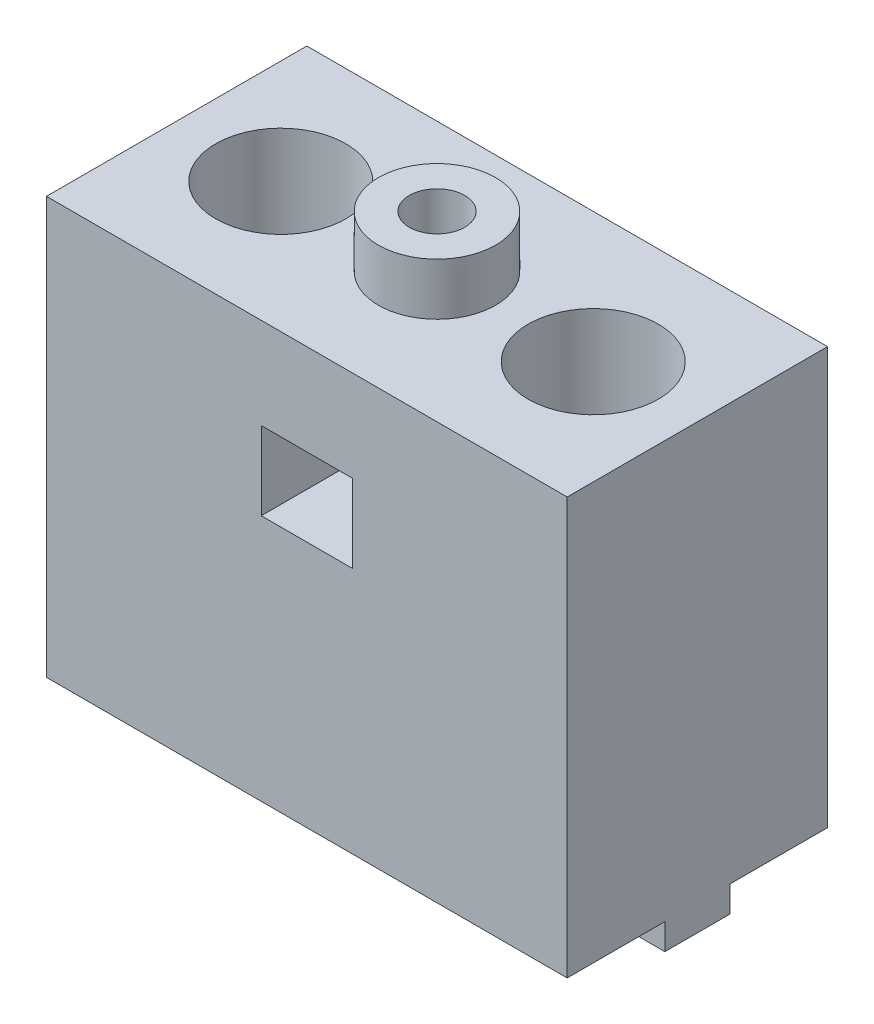
ISO-10303-21;
HEADER;
FILE_DESCRIPTION(('STEP AP214'),'2;1');
FILE_NAME('part.step','',(''),(''),'','','');
FILE_SCHEMA(('AUTOMOTIVE_DESIGN { 1 0 10303 214 1 1 1 1 }'));
ENDSEC;
DATA;
#1=APPLICATION_CONTEXT('core data for automotive mechanical design processes');
#2=APPLICATION_PROTOCOL_DEFINITION('international standard','automotive_design',2000,#1);
#3=PRODUCT_CONTEXT('',#1,'mechanical');
#4=PRODUCT('Part','Part','',(#3));
#5=PRODUCT_RELATED_PRODUCT_CATEGORY('part','',(#4));
#6=PRODUCT_DEFINITION_FORMATION('','',#4);
#7=PRODUCT_DEFINITION_CONTEXT('part definition',#1,'design');
#8=PRODUCT_DEFINITION('design','',#6,#7);
#9=PRODUCT_DEFINITION_SHAPE('','',#8);
#10=(LENGTH_UNIT() NAMED_UNIT(*) SI_UNIT(.MILLI.,.METRE.));
#11=(NAMED_UNIT(*) PLANE_ANGLE_UNIT() SI_UNIT($,.RADIAN.));
#12=(NAMED_UNIT(*) SI_UNIT($,.STERADIAN.) SOLID_ANGLE_UNIT());
#13=UNCERTAINTY_MEASURE_WITH_UNIT(LENGTH_MEASURE(1.E-05),#10,'distance_accuracy_value','');
#14=(GEOMETRIC_REPRESENTATION_CONTEXT(3) GLOBAL_UNCERTAINTY_ASSIGNED_CONTEXT((#13)) GLOBAL_UNIT_ASSIGNED_CONTEXT((#10,
#11,#12)) REPRESENTATION_CONTEXT('',''));
#15=CARTESIAN_POINT('',(0.,0.,0.));
#16=DIRECTION('',(0.,0.,1.));
#17=DIRECTION('',(1.,0.,0.));
#18=AXIS2_PLACEMENT_3D('',#15,#16,#17);
#19=CARTESIAN_POINT('',(40.,-2.,-7.5));
#20=DIRECTION('',(0.,0.,-1.));
#21=DIRECTION('',(-1.,0.,0.));
#22=AXIS2_PLACEMENT_3D('',#19,#20,#21);
#23=PLANE('',#22);
#24=DIRECTION('',(-1.,0.,0.));
#25=VECTOR('',#24,1.);
#26=CARTESIAN_POINT('',(40.,-2.,-7.5));
#27=LINE('',#26,#25);
#28=CARTESIAN_POINT('',(6.85435607626103,-2.,-7.5));
#29=VERTEX_POINT('',#28);
#30=CARTESIAN_POINT('',(0.,-2.,-7.50000000000001));
#31=VERTEX_POINT('',#30);
#32=EDGE_CURVE('E267',#29,#31,#27,.T.);
#33=ORIENTED_EDGE('',*,*,#32,.F.);
#34=DIRECTION('',(0.,1.,0.));
#35=VECTOR('',#34,1.);
#36=CARTESIAN_POINT('',(6.85435607626103,-2.,-7.5));
#37=LINE('',#36,#35);
#38=CARTESIAN_POINT('',(6.85435607626103,0.,-7.5));
#39=VERTEX_POINT('',#38);
#40=EDGE_CURVE('E241',#29,#39,#37,.T.);
#41=ORIENTED_EDGE('',*,*,#40,.T.);
#42=DIRECTION('',(-1.,0.,0.));
#43=VECTOR('',#42,1.);
#44=CARTESIAN_POINT('',(40.,0.,-7.5));
#45=LINE('',#44,#43);
#46=CARTESIAN_POINT('',(0.,0.,-7.50000000000001));
#47=VERTEX_POINT('',#46);
#48=EDGE_CURVE('E263',#39,#47,#45,.T.);
#49=ORIENTED_EDGE('',*,*,#48,.T.);
#50=DIRECTION('',(0.,1.,0.));
#51=VECTOR('',#50,1.);
#52=CARTESIAN_POINT('',(0.,-2.,-7.50000000000001));
#53=LINE('',#52,#51);
#54=EDGE_CURVE('E294',#31,#47,#53,.T.);
#55=ORIENTED_EDGE('',*,*,#54,.F.);
#56=EDGE_LOOP('',(#33,#41,#49,#55));
#57=FACE_BOUND('',#56,.T.);
#58=ADVANCED_FACE('F35',(#57),#23,.F.);
#59=CARTESIAN_POINT('',(40.,-2.,-12.5));
#60=DIRECTION('',(0.,0.,1.));
#61=DIRECTION('',(1.,0.,0.));
#62=AXIS2_PLACEMENT_3D('',#59,#60,#61);
#63=PLANE('',#62);
#64=DIRECTION('',(1.,0.,0.));
#65=VECTOR('',#64,1.);
#66=CARTESIAN_POINT('',(40.,-2.,-12.5));
#67=LINE('',#66,#65);
#68=CARTESIAN_POINT('',(9.14564392373894,-2.,-12.5));
#69=VERTEX_POINT('',#68);
#70=CARTESIAN_POINT('',(30.854356076261,-2.,-12.5));
#71=VERTEX_POINT('',#70);
#72=EDGE_CURVE('E280',#69,#71,#67,.T.);
#73=ORIENTED_EDGE('',*,*,#72,.F.);
#74=DIRECTION('',(0.,1.,0.));
#75=VECTOR('',#74,1.);
#76=CARTESIAN_POINT('',(9.14564392373895,-2.,-12.5));
#77=LINE('',#76,#75);
#78=CARTESIAN_POINT('',(9.14564392373894,0.,-12.5));
#79=VERTEX_POINT('',#78);
#80=EDGE_CURVE('E233',#69,#79,#77,.T.);
#81=ORIENTED_EDGE('',*,*,#80,.T.);
#82=DIRECTION('',(1.,0.,0.));
#83=VECTOR('',#82,1.);
#84=CARTESIAN_POINT('',(40.,0.,-12.5));
#85=LINE('',#84,#83);
#86=CARTESIAN_POINT('',(30.854356076261,0.,-12.5));
#87=VERTEX_POINT('',#86);
#88=EDGE_CURVE('E288',#79,#87,#85,.T.);
#89=ORIENTED_EDGE('',*,*,#88,.T.);
#90=DIRECTION('',(0.,1.,0.));
#91=VECTOR('',#90,1.);
#92=CARTESIAN_POINT('',(30.854356076261,-2.,-12.5));
#93=LINE('',#92,#91);
#94=EDGE_CURVE('E247',#87,#71,#93,.F.);
#95=ORIENTED_EDGE('',*,*,#94,.T.);
#96=EDGE_LOOP('',(#73,#81,#89,#95));
#97=FACE_BOUND('',#96,.T.);
#98=ADVANCED_FACE('F361',(#97),#63,.F.);
#99=CARTESIAN_POINT('',(0.,-2.,0.));
#100=DIRECTION('',(0.,1.,0.));
#101=DIRECTION('',(0.,0.,1.));
#102=AXIS2_PLACEMENT_3D('',#99,#100,#101);
#103=PLANE('',#102);
#104=CARTESIAN_POINT('',(30.854356076261,-2.,-7.5));
#105=VERTEX_POINT('',#104);
#106=CARTESIAN_POINT('',(9.14564392373897,-2.,-7.5));
#107=VERTEX_POINT('',#106);
#108=EDGE_CURVE('E273',#105,#107,#27,.T.);
#109=ORIENTED_EDGE('',*,*,#108,.T.);
#110=CARTESIAN_POINT('',(8.,-2.,-10.));
#111=DIRECTION('',(0.,1.,0.));
#112=DIRECTION('',(0.,0.,1.));
#113=AXIS2_PLACEMENT_3D('',#110,#111,#112);
#114=CIRCLE('',#113,2.75);
#115=EDGE_CURVE('E225',#107,#69,#114,.T.);
#116=ORIENTED_EDGE('',*,*,#115,.T.);
#117=ORIENTED_EDGE('',*,*,#72,.T.);
#118=CARTESIAN_POINT('',(32.,-2.,-10.));
#119=DIRECTION('',(0.,1.,0.));
#120=DIRECTION('',(0.,0.,1.));
#121=AXIS2_PLACEMENT_3D('',#118,#119,#120);
#122=CIRCLE('',#121,2.75);
#123=EDGE_CURVE('E333',#71,#105,#122,.T.);
#124=ORIENTED_EDGE('',*,*,#123,.T.);
#125=EDGE_LOOP('',(#109,#116,#117,#124));
#126=FACE_BOUND('',#125,.T.);
#127=ADVANCED_FACE('F369',(#126),#103,.F.);
#128=CARTESIAN_POINT('',(30.854356076261,0.,-7.5));
#129=VERTEX_POINT('',#128);
#130=CARTESIAN_POINT('',(9.14564392373897,0.,-7.5));
#131=VERTEX_POINT('',#130);
#132=EDGE_CURVE('E285',#129,#131,#45,.T.);
#133=ORIENTED_EDGE('',*,*,#132,.T.);
#134=DIRECTION('',(0.,1.,0.));
#135=VECTOR('',#134,1.);
#136=CARTESIAN_POINT('',(9.14564392373897,-2.,-7.5));
#137=LINE('',#136,#135);
#138=EDGE_CURVE('E238',#131,#107,#137,.F.);
#139=ORIENTED_EDGE('',*,*,#138,.T.);
#140=ORIENTED_EDGE('',*,*,#108,.F.);
#141=DIRECTION('',(0.,1.,0.));
#142=VECTOR('',#141,1.);
#143=CARTESIAN_POINT('',(30.854356076261,-2.,-7.5));
#144=LINE('',#143,#142);
#145=EDGE_CURVE('E260',#105,#129,#144,.T.);
#146=ORIENTED_EDGE('',*,*,#145,.T.);
#147=EDGE_LOOP('',(#133,#139,#140,#146));
#148=FACE_BOUND('',#147,.T.);
#149=ADVANCED_FACE('F364',(#148),#23,.F.);
#150=CARTESIAN_POINT('',(33.145643923739,-2.,-12.5));
#151=VERTEX_POINT('',#150);
#152=CARTESIAN_POINT('',(40.,-2.,-12.5));
#153=VERTEX_POINT('',#152);
#154=EDGE_CURVE('E275',#151,#153,#67,.T.);
#155=ORIENTED_EDGE('',*,*,#154,.F.);
#156=DIRECTION('',(0.,1.,0.));
#157=VECTOR('',#156,1.);
#158=CARTESIAN_POINT('',(33.145643923739,-2.,-12.5));
#159=LINE('',#158,#157);
#160=CARTESIAN_POINT('',(33.145643923739,0.,-12.5));
#161=VERTEX_POINT('',#160);
#162=EDGE_CURVE('E252',#151,#161,#159,.T.);
#163=ORIENTED_EDGE('',*,*,#162,.T.);
#164=CARTESIAN_POINT('',(40.,0.,-12.5));
#165=VERTEX_POINT('',#164);
#166=EDGE_CURVE('E284',#161,#165,#85,.T.);
#167=ORIENTED_EDGE('',*,*,#166,.T.);
#168=DIRECTION('',(0.,1.,0.));
#169=VECTOR('',#168,1.);
#170=CARTESIAN_POINT('',(40.,-2.,-12.5));
#171=LINE('',#170,#169);
#172=EDGE_CURVE('E279',#153,#165,#171,.T.);
#173=ORIENTED_EDGE('',*,*,#172,.F.);
#174=EDGE_LOOP('',(#155,#163,#167,#173));
#175=FACE_BOUND('',#174,.T.);
#176=ADVANCED_FACE('F372',(#175),#63,.F.);
#177=CARTESIAN_POINT('',(40.,-2.,-7.5));
#178=VERTEX_POINT('',#177);
#179=CARTESIAN_POINT('',(33.145643923739,-2.,-7.5));
#180=VERTEX_POINT('',#179);
#181=EDGE_CURVE('E269',#178,#180,#27,.T.);
#182=ORIENTED_EDGE('',*,*,#181,.T.);
#183=CARTESIAN_POINT('',(32.,-2.,-10.));
#184=DIRECTION('',(0.,1.,0.));
#185=DIRECTION('',(0.,0.,1.));
#186=AXIS2_PLACEMENT_3D('',#183,#184,#185);
#187=CIRCLE('',#186,2.75);
#188=EDGE_CURVE('E244',#180,#151,#187,.T.);
#189=ORIENTED_EDGE('',*,*,#188,.T.);
#190=ORIENTED_EDGE('',*,*,#154,.T.);
#191=DIRECTION('',(0.,0.,1.));
#192=VECTOR('',#191,1.);
#193=CARTESIAN_POINT('',(40.,-2.,-7.5));
#194=LINE('',#193,#192);
#195=EDGE_CURVE('E264',#153,#178,#194,.T.);
#196=ORIENTED_EDGE('',*,*,#195,.T.);
#197=EDGE_LOOP('',(#182,#189,#190,#196));
#198=FACE_BOUND('',#197,.T.);
#199=ADVANCED_FACE('F425',(#198),#103,.F.);
#200=CARTESIAN_POINT('',(0.,0.,0.));
#201=DIRECTION('',(0.,-1.,0.));
#202=DIRECTION('',(0.,0.,-1.));
#203=AXIS2_PLACEMENT_3D('',#200,#201,#202);
#204=PLANE('',#203);
#205=CARTESIAN_POINT('',(8.,0.,-10.));
#206=DIRECTION('',(0.,-1.,0.));
#207=DIRECTION('',(0.,0.,-1.));
#208=AXIS2_PLACEMENT_3D('',#205,#206,#207);
#209=CIRCLE('',#208,2.75);
#210=CARTESIAN_POINT('',(6.85435607626105,0.,-12.5));
#211=VERTEX_POINT('',#210);
#212=EDGE_CURVE('E231',#211,#79,#209,.T.);
#213=ORIENTED_EDGE('',*,*,#212,.F.);
#214=CARTESIAN_POINT('',(0.,0.,-12.5));
#215=VERTEX_POINT('',#214);
#216=EDGE_CURVE('E268',#215,#211,#85,.T.);
#217=ORIENTED_EDGE('',*,*,#216,.F.);
#218=DIRECTION('',(0.,0.,1.));
#219=VECTOR('',#218,1.);
#220=CARTESIAN_POINT('',(0.,0.,0.));
#221=LINE('',#220,#219);
#222=CARTESIAN_POINT('',(0.,0.,-20.));
#223=VERTEX_POINT('',#222);
#224=EDGE_CURVE('E312',#223,#215,#221,.T.);
#225=ORIENTED_EDGE('',*,*,#224,.F.);
#226=DIRECTION('',(-1.,0.,0.));
#227=VECTOR('',#226,1.);
#228=CARTESIAN_POINT('',(0.,0.,-20.));
#229=LINE('',#228,#227);
#230=CARTESIAN_POINT('',(40.,0.,-20.));
#231=VERTEX_POINT('',#230);
#232=EDGE_CURVE('E305',#231,#223,#229,.T.);
#233=ORIENTED_EDGE('',*,*,#232,.F.);
#234=DIRECTION('',(0.,0.,-1.));
#235=VECTOR('',#234,1.);
#236=CARTESIAN_POINT('',(40.,0.,0.));
#237=LINE('',#236,#235);
#238=EDGE_CURVE('E317',#165,#231,#237,.T.);
#239=ORIENTED_EDGE('',*,*,#238,.F.);
#240=ORIENTED_EDGE('',*,*,#166,.F.);
#241=CARTESIAN_POINT('',(32.,0.,-10.));
#242=DIRECTION('',(0.,-1.,0.));
#243=DIRECTION('',(0.,0.,-1.));
#244=AXIS2_PLACEMENT_3D('',#241,#242,#243);
#245=CIRCLE('',#244,2.75);
#246=EDGE_CURVE('E250',#87,#161,#245,.T.);
#247=ORIENTED_EDGE('',*,*,#246,.F.);
#248=ORIENTED_EDGE('',*,*,#88,.F.);
#249=EDGE_LOOP('',(#213,#217,#225,#233,#239,#240,#247,#248));
#250=FACE_BOUND('',#249,.T.);
#251=ADVANCED_FACE('F390',(#250),#204,.T.);
#252=CARTESIAN_POINT('',(0.,32.,0.));
#253=DIRECTION('',(1.,0.,0.));
#254=DIRECTION('',(0.,0.,-1.));
#255=AXIS2_PLACEMENT_3D('',#252,#253,#254);
#256=PLANE('',#255);
#257=ORIENTED_EDGE('',*,*,#224,.T.);
#258=DIRECTION('',(0.,1.,0.));
#259=VECTOR('',#258,1.);
#260=CARTESIAN_POINT('',(0.,-2.,-12.5));
#261=LINE('',#260,#259);
#262=CARTESIAN_POINT('',(0.,-2.,-12.5));
#263=VERTEX_POINT('',#262);
#264=EDGE_CURVE('E291',#263,#215,#261,.T.);
#265=ORIENTED_EDGE('',*,*,#264,.F.);
#266=DIRECTION('',(0.,0.,-1.));
#267=VECTOR('',#266,1.);
#268=CARTESIAN_POINT('',(0.,-2.,-7.50000000000001));
#269=LINE('',#268,#267);
#270=EDGE_CURVE('E272',#31,#263,#269,.T.);
#271=ORIENTED_EDGE('',*,*,#270,.F.);
#272=ORIENTED_EDGE('',*,*,#54,.T.);
#273=CARTESIAN_POINT('',(0.,0.,0.));
#274=VERTEX_POINT('',#273);
#275=EDGE_CURVE('E300',#47,#274,#221,.T.);
#276=ORIENTED_EDGE('',*,*,#275,.T.);
#277=DIRECTION('',(0.,-1.,0.));
#278=VECTOR('',#277,1.);
#279=CARTESIAN_POINT('',(0.,32.,0.));
#280=LINE('',#279,#278);
#281=CARTESIAN_POINT('',(0.,32.,0.));
#282=VERTEX_POINT('',#281);
#283=EDGE_CURVE('E330',#282,#274,#280,.T.);
#284=ORIENTED_EDGE('',*,*,#283,.F.);
#285=DIRECTION('',(0.,0.,1.));
#286=VECTOR('',#285,1.);
#287=CARTESIAN_POINT('',(0.,32.,0.));
#288=LINE('',#287,#286);
#289=CARTESIAN_POINT('',(0.,32.,-20.));
#290=VERTEX_POINT('',#289);
#291=EDGE_CURVE('E301',#290,#282,#288,.T.);
#292=ORIENTED_EDGE('',*,*,#291,.F.);
#293=DIRECTION('',(0.,-1.,0.));
#294=VECTOR('',#293,1.);
#295=CARTESIAN_POINT('',(0.,32.,-20.));
#296=LINE('',#295,#294);
#297=EDGE_CURVE('E311',#290,#223,#296,.T.);
#298=ORIENTED_EDGE('',*,*,#297,.T.);
#299=EDGE_LOOP('',(#257,#265,#271,#272,#276,#284,#292,#298));
#300=FACE_BOUND('',#299,.T.);
#301=ADVANCED_FACE('F37',(#300),#256,.F.);
#302=CARTESIAN_POINT('',(0.,32.,0.));
#303=DIRECTION('',(0.,0.,-1.));
#304=DIRECTION('',(-1.,0.,0.));
#305=AXIS2_PLACEMENT_3D('',#302,#303,#304);
#306=PLANE('',#305);
#307=DIRECTION('',(1.,0.,0.));
#308=VECTOR('',#307,1.);
#309=CARTESIAN_POINT('',(16.5,19.,0.));
#310=LINE('',#309,#308);
#311=CARTESIAN_POINT('',(16.5,19.,0.));
#312=VERTEX_POINT('',#311);
#313=CARTESIAN_POINT('',(23.5,19.,0.));
#314=VERTEX_POINT('',#313);
#315=EDGE_CURVE('E202',#312,#314,#310,.T.);
#316=ORIENTED_EDGE('',*,*,#315,.F.);
#317=DIRECTION('',(0.,-1.,0.));
#318=VECTOR('',#317,1.);
#319=CARTESIAN_POINT('',(16.5,19.,0.));
#320=LINE('',#319,#318);
#321=CARTESIAN_POINT('',(16.5,25.,0.));
#322=VERTEX_POINT('',#321);
#323=EDGE_CURVE('E50',#322,#312,#320,.T.);
#324=ORIENTED_EDGE('',*,*,#323,.F.);
#325=DIRECTION('',(-1.,0.,0.));
#326=VECTOR('',#325,1.);
#327=CARTESIAN_POINT('',(16.5,25.,0.));
#328=LINE('',#327,#326);
#329=CARTESIAN_POINT('',(23.5,25.,0.));
#330=VERTEX_POINT('',#329);
#331=EDGE_CURVE('E190',#330,#322,#328,.T.);
#332=ORIENTED_EDGE('',*,*,#331,.F.);
#333=DIRECTION('',(0.,1.,0.));
#334=VECTOR('',#333,1.);
#335=CARTESIAN_POINT('',(23.5,19.,0.));
#336=LINE('',#335,#334);
#337=EDGE_CURVE('E193',#314,#330,#336,.T.);
#338=ORIENTED_EDGE('',*,*,#337,.F.);
#339=EDGE_LOOP('',(#316,#324,#332,#338));
#340=FACE_BOUND('',#339,.T.);
#341=DIRECTION('',(1.,0.,0.));
#342=VECTOR('',#341,1.);
#343=CARTESIAN_POINT('',(0.,0.,0.));
#344=LINE('',#343,#342);
#345=CARTESIAN_POINT('',(40.,0.,0.));
#346=VERTEX_POINT('',#345);
#347=EDGE_CURVE('E315',#274,#346,#344,.T.);
#348=ORIENTED_EDGE('',*,*,#347,.T.);
#349=DIRECTION('',(0.,-1.,0.));
#350=VECTOR('',#349,1.);
#351=CARTESIAN_POINT('',(40.,32.,0.));
#352=LINE('',#351,#350);
#353=CARTESIAN_POINT('',(40.,32.,0.));
#354=VERTEX_POINT('',#353);
#355=EDGE_CURVE('E327',#354,#346,#352,.T.);
#356=ORIENTED_EDGE('',*,*,#355,.F.);
#357=DIRECTION('',(1.,0.,0.));
#358=VECTOR('',#357,1.);
#359=CARTESIAN_POINT('',(0.,32.,0.));
#360=LINE('',#359,#358);
#361=EDGE_CURVE('E304',#282,#354,#360,.T.);
#362=ORIENTED_EDGE('',*,*,#361,.F.);
#363=ORIENTED_EDGE('',*,*,#283,.T.);
#364=EDGE_LOOP('',(#348,#356,#362,#363));
#365=FACE_BOUND('',#364,.T.);
#366=ADVANCED_FACE('F404',(#340,#365),#306,.F.);
#367=CARTESIAN_POINT('',(40.,32.,0.));
#368=DIRECTION('',(-1.,0.,0.));
#369=DIRECTION('',(0.,0.,1.));
#370=AXIS2_PLACEMENT_3D('',#367,#368,#369);
#371=PLANE('',#370);
#372=CARTESIAN_POINT('',(40.,0.,-7.5));
#373=VERTEX_POINT('',#372);
#374=EDGE_CURVE('E318',#346,#373,#237,.T.);
#375=ORIENTED_EDGE('',*,*,#374,.T.);
#376=DIRECTION('',(0.,1.,0.));
#377=VECTOR('',#376,1.);
#378=CARTESIAN_POINT('',(40.,-2.,-7.5));
#379=LINE('',#378,#377);
#380=EDGE_CURVE('E297',#178,#373,#379,.T.);
#381=ORIENTED_EDGE('',*,*,#380,.F.);
#382=ORIENTED_EDGE('',*,*,#195,.F.);
#383=ORIENTED_EDGE('',*,*,#172,.T.);
#384=ORIENTED_EDGE('',*,*,#238,.T.);
#385=DIRECTION('',(0.,-1.,0.));
#386=VECTOR('',#385,1.);
#387=CARTESIAN_POINT('',(40.,32.,-20.));
#388=LINE('',#387,#386);
#389=CARTESIAN_POINT('',(40.,32.,-20.));
#390=VERTEX_POINT('',#389);
#391=EDGE_CURVE('E324',#390,#231,#388,.T.);
#392=ORIENTED_EDGE('',*,*,#391,.F.);
#393=DIRECTION('',(0.,0.,-1.));
#394=VECTOR('',#393,1.);
#395=CARTESIAN_POINT('',(40.,32.,0.));
#396=LINE('',#395,#394);
#397=EDGE_CURVE('E307',#354,#390,#396,.T.);
#398=ORIENTED_EDGE('',*,*,#397,.F.);
#399=ORIENTED_EDGE('',*,*,#355,.T.);
#400=EDGE_LOOP('',(#375,#381,#382,#383,#384,#392,#398,#399));
#401=FACE_BOUND('',#400,.T.);
#402=ADVANCED_FACE('F398',(#401),#371,.F.);
#403=CARTESIAN_POINT('',(0.,32.,-20.));
#404=DIRECTION('',(0.,0.,1.));
#405=DIRECTION('',(1.,0.,0.));
#406=AXIS2_PLACEMENT_3D('',#403,#404,#405);
#407=PLANE('',#406);
#408=DIRECTION('',(-1.,0.,0.));
#409=VECTOR('',#408,1.);
#410=CARTESIAN_POINT('',(16.5,25.,-20.));
#411=LINE('',#410,#409);
#412=CARTESIAN_POINT('',(23.5,25.,-20.));
#413=VERTEX_POINT('',#412);
#414=CARTESIAN_POINT('',(16.5,25.,-20.));
#415=VERTEX_POINT('',#414);
#416=EDGE_CURVE('E180',#413,#415,#411,.T.);
#417=ORIENTED_EDGE('',*,*,#416,.T.);
#418=DIRECTION('',(0.,-1.,0.));
#419=VECTOR('',#418,1.);
#420=CARTESIAN_POINT('',(16.5,19.,-20.));
#421=LINE('',#420,#419);
#422=CARTESIAN_POINT('',(16.5,19.,-20.));
#423=VERTEX_POINT('',#422);
#424=EDGE_CURVE('E174',#415,#423,#421,.T.);
#425=ORIENTED_EDGE('',*,*,#424,.T.);
#426=DIRECTION('',(1.,0.,0.));
#427=VECTOR('',#426,1.);
#428=CARTESIAN_POINT('',(16.5,19.,-20.));
#429=LINE('',#428,#427);
#430=CARTESIAN_POINT('',(23.5,19.,-20.));
#431=VERTEX_POINT('',#430);
#432=EDGE_CURVE('E183',#423,#431,#429,.T.);
#433=ORIENTED_EDGE('',*,*,#432,.T.);
#434=DIRECTION('',(0.,1.,0.));
#435=VECTOR('',#434,1.);
#436=CARTESIAN_POINT('',(23.5,19.,-20.));
#437=LINE('',#436,#435);
#438=EDGE_CURVE('E58',#431,#413,#437,.T.);
#439=ORIENTED_EDGE('',*,*,#438,.T.);
#440=EDGE_LOOP('',(#417,#425,#433,#439));
#441=FACE_BOUND('',#440,.T.);
#442=ORIENTED_EDGE('',*,*,#232,.T.);
#443=ORIENTED_EDGE('',*,*,#297,.F.);
#444=DIRECTION('',(-1.,0.,0.));
#445=VECTOR('',#444,1.);
#446=CARTESIAN_POINT('',(0.,32.,-20.));
#447=LINE('',#446,#445);
#448=EDGE_CURVE('E309',#390,#290,#447,.T.);
#449=ORIENTED_EDGE('',*,*,#448,.F.);
#450=ORIENTED_EDGE('',*,*,#391,.T.);
#451=EDGE_LOOP('',(#442,#443,#449,#450));
#452=FACE_BOUND('',#451,.T.);
#453=ADVANCED_FACE('F187',(#441,#452),#407,.F.);
#454=CARTESIAN_POINT('',(0.,32.,0.));
#455=DIRECTION('',(0.,-1.,0.));
#456=DIRECTION('',(0.,0.,-1.));
#457=AXIS2_PLACEMENT_3D('',#454,#455,#456);
#458=PLANE('',#457);
#459=CARTESIAN_POINT('',(20.,32.,-10.));
#460=DIRECTION('',(0.,-1.,0.));
#461=DIRECTION('',(0.,0.,-1.));
#462=AXIS2_PLACEMENT_3D('',#459,#460,#461);
#463=CIRCLE('',#462,4.5);
#464=CARTESIAN_POINT('',(20.,32.,-14.5));
#465=VERTEX_POINT('',#464);
#466=EDGE_CURVE('E12',#465,#465,#463,.F.);
#467=ORIENTED_EDGE('',*,*,#466,.F.);
#468=EDGE_LOOP('',(#467));
#469=FACE_BOUND('',#468,.T.);
#470=CARTESIAN_POINT('',(32.,32.,-10.));
#471=DIRECTION('',(0.,1.,0.));
#472=DIRECTION('',(0.,0.,1.));
#473=AXIS2_PLACEMENT_3D('',#470,#471,#472);
#474=CIRCLE('',#473,5.);
#475=CARTESIAN_POINT('',(32.,32.,-5.));
#476=VERTEX_POINT('',#475);
#477=EDGE_CURVE('E208',#476,#476,#474,.T.);
#478=ORIENTED_EDGE('',*,*,#477,.F.);
#479=EDGE_LOOP('',(#478));
#480=FACE_BOUND('',#479,.T.);
#481=CARTESIAN_POINT('',(8.,32.,-10.));
#482=DIRECTION('',(0.,1.,0.));
#483=DIRECTION('',(0.,0.,1.));
#484=AXIS2_PLACEMENT_3D('',#481,#482,#483);
#485=CIRCLE('',#484,5.);
#486=CARTESIAN_POINT('',(8.,32.,-5.));
#487=VERTEX_POINT('',#486);
#488=EDGE_CURVE('E218',#487,#487,#485,.T.);
#489=ORIENTED_EDGE('',*,*,#488,.F.);
#490=EDGE_LOOP('',(#489));
#491=FACE_BOUND('',#490,.T.);
#492=ORIENTED_EDGE('',*,*,#291,.T.);
#493=ORIENTED_EDGE('',*,*,#361,.T.);
#494=ORIENTED_EDGE('',*,*,#397,.T.);
#495=ORIENTED_EDGE('',*,*,#448,.T.);
#496=EDGE_LOOP('',(#492,#493,#494,#495));
#497=FACE_BOUND('',#496,.T.);
#498=ADVANCED_FACE('F387',(#469,#480,#491,#497),#458,.F.);
#499=CARTESIAN_POINT('',(8.,0.,-10.));
#500=DIRECTION('',(0.,-1.,0.));
#501=DIRECTION('',(0.,0.,-1.));
#502=AXIS2_PLACEMENT_3D('',#499,#500,#501);
#503=CIRCLE('',#502,2.75);
#504=EDGE_CURVE('E236',#131,#39,#503,.T.);
#505=ORIENTED_EDGE('',*,*,#504,.F.);
#506=ORIENTED_EDGE('',*,*,#132,.F.);
#507=CARTESIAN_POINT('',(32.,0.,-10.));
#508=DIRECTION('',(0.,-1.,0.));
#509=DIRECTION('',(0.,0.,-1.));
#510=AXIS2_PLACEMENT_3D('',#507,#508,#509);
#511=CIRCLE('',#510,2.75);
#512=CARTESIAN_POINT('',(33.145643923739,0.,-7.5));
#513=VERTEX_POINT('',#512);
#514=EDGE_CURVE('E258',#513,#129,#511,.T.);
#515=ORIENTED_EDGE('',*,*,#514,.F.);
#516=EDGE_CURVE('E281',#373,#513,#45,.T.);
#517=ORIENTED_EDGE('',*,*,#516,.F.);
#518=ORIENTED_EDGE('',*,*,#374,.F.);
#519=ORIENTED_EDGE('',*,*,#347,.F.);
#520=ORIENTED_EDGE('',*,*,#275,.F.);
#521=ORIENTED_EDGE('',*,*,#48,.F.);
#522=EDGE_LOOP('',(#505,#506,#515,#517,#518,#519,#520,#521));
#523=FACE_BOUND('',#522,.T.);
#524=ADVANCED_FACE('F379',(#523),#204,.T.);
#525=ORIENTED_EDGE('',*,*,#516,.T.);
#526=DIRECTION('',(0.,1.,0.));
#527=VECTOR('',#526,1.);
#528=CARTESIAN_POINT('',(33.145643923739,-2.,-7.5));
#529=LINE('',#528,#527);
#530=EDGE_CURVE('E255',#513,#180,#529,.F.);
#531=ORIENTED_EDGE('',*,*,#530,.T.);
#532=ORIENTED_EDGE('',*,*,#181,.F.);
#533=ORIENTED_EDGE('',*,*,#380,.T.);
#534=EDGE_LOOP('',(#525,#531,#532,#533));
#535=FACE_BOUND('',#534,.T.);
#536=ADVANCED_FACE('F365',(#535),#23,.F.);
#537=ORIENTED_EDGE('',*,*,#216,.T.);
#538=DIRECTION('',(0.,1.,0.));
#539=VECTOR('',#538,1.);
#540=CARTESIAN_POINT('',(6.85435607626105,-2.,-12.5));
#541=LINE('',#540,#539);
#542=CARTESIAN_POINT('',(6.85435607626106,-2.,-12.5));
#543=VERTEX_POINT('',#542);
#544=EDGE_CURVE('E228',#211,#543,#541,.F.);
#545=ORIENTED_EDGE('',*,*,#544,.T.);
#546=EDGE_CURVE('E276',#263,#543,#67,.T.);
#547=ORIENTED_EDGE('',*,*,#546,.F.);
#548=ORIENTED_EDGE('',*,*,#264,.T.);
#549=EDGE_LOOP('',(#537,#545,#547,#548));
#550=FACE_BOUND('',#549,.T.);
#551=ADVANCED_FACE('F373',(#550),#63,.F.);
#552=ORIENTED_EDGE('',*,*,#546,.T.);
#553=CARTESIAN_POINT('',(8.,-2.,-10.));
#554=DIRECTION('',(0.,1.,0.));
#555=DIRECTION('',(0.,0.,1.));
#556=AXIS2_PLACEMENT_3D('',#553,#554,#555);
#557=CIRCLE('',#556,2.75);
#558=EDGE_CURVE('E43',#543,#29,#557,.T.);
#559=ORIENTED_EDGE('',*,*,#558,.T.);
#560=ORIENTED_EDGE('',*,*,#32,.T.);
#561=ORIENTED_EDGE('',*,*,#270,.T.);
#562=EDGE_LOOP('',(#552,#559,#560,#561));
#563=FACE_BOUND('',#562,.T.);
#564=ADVANCED_FACE('F385',(#563),#103,.F.);
#565=CARTESIAN_POINT('',(32.,-2.,-10.));
#566=DIRECTION('',(0.,1.,0.));
#567=DIRECTION('',(0.,0.,1.));
#568=AXIS2_PLACEMENT_3D('',#565,#566,#567);
#569=CYLINDRICAL_SURFACE('',#568,2.75);
#570=CARTESIAN_POINT('',(32.,5.,-10.));
#571=DIRECTION('',(0.,-1.,0.));
#572=DIRECTION('',(0.,0.,-1.));
#573=AXIS2_PLACEMENT_3D('',#570,#571,#572);
#574=CIRCLE('',#573,2.75);
#575=CARTESIAN_POINT('',(32.,5.,-12.75));
#576=VERTEX_POINT('',#575);
#577=EDGE_CURVE('E217',#576,#576,#574,.F.);
#578=ORIENTED_EDGE('',*,*,#577,.T.);
#579=EDGE_LOOP('',(#578));
#580=FACE_BOUND('',#579,.T.);
#581=ORIENTED_EDGE('',*,*,#123,.F.);
#582=ORIENTED_EDGE('',*,*,#94,.F.);
#583=ORIENTED_EDGE('',*,*,#246,.T.);
#584=ORIENTED_EDGE('',*,*,#162,.F.);
#585=ORIENTED_EDGE('',*,*,#188,.F.);
#586=ORIENTED_EDGE('',*,*,#530,.F.);
#587=ORIENTED_EDGE('',*,*,#514,.T.);
#588=ORIENTED_EDGE('',*,*,#145,.F.);
#589=EDGE_LOOP('',(#581,#582,#583,#584,#585,#586,#587,#588));
#590=FACE_BOUND('',#589,.T.);
#591=ADVANCED_FACE('F342',(#580,#590),#569,.F.);
#592=CARTESIAN_POINT('',(8.,-2.,-10.));
#593=DIRECTION('',(0.,1.,0.));
#594=DIRECTION('',(0.,0.,1.));
#595=AXIS2_PLACEMENT_3D('',#592,#593,#594);
#596=CYLINDRICAL_SURFACE('',#595,2.75);
#597=CARTESIAN_POINT('',(8.,5.,-10.));
#598=DIRECTION('',(0.,-1.,0.));
#599=DIRECTION('',(0.,0.,-1.));
#600=AXIS2_PLACEMENT_3D('',#597,#598,#599);
#601=CIRCLE('',#600,2.75);
#602=CARTESIAN_POINT('',(8.,5.,-12.75));
#603=VERTEX_POINT('',#602);
#604=EDGE_CURVE('E224',#603,#603,#601,.F.);
#605=ORIENTED_EDGE('',*,*,#604,.T.);
#606=EDGE_LOOP('',(#605));
#607=FACE_BOUND('',#606,.T.);
#608=ORIENTED_EDGE('',*,*,#558,.F.);
#609=ORIENTED_EDGE('',*,*,#544,.F.);
#610=ORIENTED_EDGE('',*,*,#212,.T.);
#611=ORIENTED_EDGE('',*,*,#80,.F.);
#612=ORIENTED_EDGE('',*,*,#115,.F.);
#613=ORIENTED_EDGE('',*,*,#138,.F.);
#614=ORIENTED_EDGE('',*,*,#504,.T.);
#615=ORIENTED_EDGE('',*,*,#40,.F.);
#616=EDGE_LOOP('',(#608,#609,#610,#611,#612,#613,#614,#615));
#617=FACE_BOUND('',#616,.T.);
#618=ADVANCED_FACE('F416',(#607,#617),#596,.F.);
#619=CARTESIAN_POINT('',(0.,5.,0.));
#620=DIRECTION('',(0.,-1.,0.));
#621=DIRECTION('',(0.,0.,-1.));
#622=AXIS2_PLACEMENT_3D('',#619,#620,#621);
#623=PLANE('',#622);
#624=CARTESIAN_POINT('',(8.,5.,-10.));
#625=DIRECTION('',(0.,-1.,0.));
#626=DIRECTION('',(0.,0.,-1.));
#627=AXIS2_PLACEMENT_3D('',#624,#625,#626);
#628=CIRCLE('',#627,5.);
#629=CARTESIAN_POINT('',(8.,5.,-15.));
#630=VERTEX_POINT('',#629);
#631=EDGE_CURVE('E221',#630,#630,#628,.F.);
#632=ORIENTED_EDGE('',*,*,#631,.T.);
#633=EDGE_LOOP('',(#632));
#634=FACE_BOUND('',#633,.T.);
#635=ORIENTED_EDGE('',*,*,#604,.F.);
#636=EDGE_LOOP('',(#635));
#637=FACE_BOUND('',#636,.T.);
#638=ADVANCED_FACE('F357',(#634,#637),#623,.F.);
#639=CARTESIAN_POINT('',(8.,-14.1421356237309,-10.));
#640=DIRECTION('',(0.,1.,0.));
#641=DIRECTION('',(0.,0.,1.));
#642=AXIS2_PLACEMENT_3D('',#639,#640,#641);
#643=CYLINDRICAL_SURFACE('',#642,5.);
#644=ORIENTED_EDGE('',*,*,#488,.T.);
#645=EDGE_LOOP('',(#644));
#646=FACE_BOUND('',#645,.T.);
#647=ORIENTED_EDGE('',*,*,#631,.F.);
#648=EDGE_LOOP('',(#647));
#649=FACE_BOUND('',#648,.T.);
#650=ADVANCED_FACE('F348',(#646,#649),#643,.F.);
#651=CARTESIAN_POINT('',(0.,5.,0.));
#652=DIRECTION('',(0.,-1.,0.));
#653=DIRECTION('',(0.,0.,-1.));
#654=AXIS2_PLACEMENT_3D('',#651,#652,#653);
#655=PLANE('',#654);
#656=CARTESIAN_POINT('',(32.,5.,-10.));
#657=DIRECTION('',(0.,-1.,0.));
#658=DIRECTION('',(0.,0.,-1.));
#659=AXIS2_PLACEMENT_3D('',#656,#657,#658);
#660=CIRCLE('',#659,5.);
#661=CARTESIAN_POINT('',(32.,5.,-15.));
#662=VERTEX_POINT('',#661);
#663=EDGE_CURVE('E214',#662,#662,#660,.F.);
#664=ORIENTED_EDGE('',*,*,#663,.T.);
#665=EDGE_LOOP('',(#664));
#666=FACE_BOUND('',#665,.T.);
#667=ORIENTED_EDGE('',*,*,#577,.F.);
#668=EDGE_LOOP('',(#667));
#669=FACE_BOUND('',#668,.T.);
#670=ADVANCED_FACE('F345',(#666,#669),#655,.F.);
#671=CARTESIAN_POINT('',(32.,-14.1421356237309,-10.));
#672=DIRECTION('',(0.,1.,0.));
#673=DIRECTION('',(0.,0.,1.));
#674=AXIS2_PLACEMENT_3D('',#671,#672,#673);
#675=CYLINDRICAL_SURFACE('',#674,5.);
#676=ORIENTED_EDGE('',*,*,#477,.T.);
#677=EDGE_LOOP('',(#676));
#678=FACE_BOUND('',#677,.T.);
#679=ORIENTED_EDGE('',*,*,#663,.F.);
#680=EDGE_LOOP('',(#679));
#681=FACE_BOUND('',#680,.T.);
#682=ADVANCED_FACE('F347',(#678,#681),#675,.F.);
#683=CARTESIAN_POINT('',(16.5,19.,-20.));
#684=DIRECTION('',(-1.,0.,0.));
#685=DIRECTION('',(0.,0.,1.));
#686=AXIS2_PLACEMENT_3D('',#683,#684,#685);
#687=PLANE('',#686);
#688=ORIENTED_EDGE('',*,*,#323,.T.);
#689=DIRECTION('',(0.,0.,1.));
#690=VECTOR('',#689,1.);
#691=CARTESIAN_POINT('',(16.5,19.,-20.));
#692=LINE('',#691,#690);
#693=EDGE_CURVE('E170',#423,#312,#692,.T.);
#694=ORIENTED_EDGE('',*,*,#693,.F.);
#695=ORIENTED_EDGE('',*,*,#424,.F.);
#696=DIRECTION('',(0.,0.,1.));
#697=VECTOR('',#696,1.);
#698=CARTESIAN_POINT('',(16.5,25.,-20.));
#699=LINE('',#698,#697);
#700=EDGE_CURVE('E206',#415,#322,#699,.T.);
#701=ORIENTED_EDGE('',*,*,#700,.T.);
#702=EDGE_LOOP('',(#688,#694,#695,#701));
#703=FACE_BOUND('',#702,.T.);
#704=ADVANCED_FACE('F172',(#703),#687,.F.);
#705=CARTESIAN_POINT('',(16.5,25.,-20.));
#706=DIRECTION('',(0.,1.,0.));
#707=DIRECTION('',(0.,0.,1.));
#708=AXIS2_PLACEMENT_3D('',#705,#706,#707);
#709=PLANE('',#708);
#710=CARTESIAN_POINT('',(20.,25.,-10.));
#711=DIRECTION('',(0.,1.,0.));
#712=DIRECTION('',(0.,0.,1.));
#713=AXIS2_PLACEMENT_3D('',#710,#711,#712);
#714=CIRCLE('',#713,2.125);
#715=CARTESIAN_POINT('',(20.,25.,-7.875));
#716=VERTEX_POINT('',#715);
#717=EDGE_CURVE('E598',#716,#716,#714,.T.);
#718=ORIENTED_EDGE('',*,*,#717,.T.);
#719=EDGE_LOOP('',(#718));
#720=FACE_BOUND('',#719,.T.);
#721=ORIENTED_EDGE('',*,*,#331,.T.);
#722=ORIENTED_EDGE('',*,*,#700,.F.);
#723=ORIENTED_EDGE('',*,*,#416,.F.);
#724=DIRECTION('',(0.,0.,1.));
#725=VECTOR('',#724,1.);
#726=CARTESIAN_POINT('',(23.5,25.,-20.));
#727=LINE('',#726,#725);
#728=EDGE_CURVE('E209',#413,#330,#727,.T.);
#729=ORIENTED_EDGE('',*,*,#728,.T.);
#730=EDGE_LOOP('',(#721,#722,#723,#729));
#731=FACE_BOUND('',#730,.T.);
#732=ADVANCED_FACE('F504',(#720,#731),#709,.F.);
#733=CARTESIAN_POINT('',(23.5,19.,-20.));
#734=DIRECTION('',(1.,0.,0.));
#735=DIRECTION('',(0.,0.,-1.));
#736=AXIS2_PLACEMENT_3D('',#733,#734,#735);
#737=PLANE('',#736);
#738=ORIENTED_EDGE('',*,*,#337,.T.);
#739=ORIENTED_EDGE('',*,*,#728,.F.);
#740=ORIENTED_EDGE('',*,*,#438,.F.);
#741=DIRECTION('',(0.,0.,1.));
#742=VECTOR('',#741,1.);
#743=CARTESIAN_POINT('',(23.5,19.,-20.));
#744=LINE('',#743,#742);
#745=EDGE_CURVE('E179',#431,#314,#744,.T.);
#746=ORIENTED_EDGE('',*,*,#745,.T.);
#747=EDGE_LOOP('',(#738,#739,#740,#746));
#748=FACE_BOUND('',#747,.T.);
#749=ADVANCED_FACE('F511',(#748),#737,.F.);
#750=CARTESIAN_POINT('',(16.5,19.,-20.));
#751=DIRECTION('',(0.,-1.,0.));
#752=DIRECTION('',(0.,0.,-1.));
#753=AXIS2_PLACEMENT_3D('',#750,#751,#752);
#754=PLANE('',#753);
#755=CARTESIAN_POINT('',(20.,19.,-10.));
#756=DIRECTION('',(0.,-1.,0.));
#757=DIRECTION('',(0.,0.,-1.));
#758=AXIS2_PLACEMENT_3D('',#755,#756,#757);
#759=CIRCLE('',#758,2.125);
#760=CARTESIAN_POINT('',(20.,19.,-12.125));
#761=VERTEX_POINT('',#760);
#762=EDGE_CURVE('E594',#761,#761,#759,.T.);
#763=ORIENTED_EDGE('',*,*,#762,.T.);
#764=EDGE_LOOP('',(#763));
#765=FACE_BOUND('',#764,.T.);
#766=ORIENTED_EDGE('',*,*,#315,.T.);
#767=ORIENTED_EDGE('',*,*,#745,.F.);
#768=ORIENTED_EDGE('',*,*,#432,.F.);
#769=ORIENTED_EDGE('',*,*,#693,.T.);
#770=EDGE_LOOP('',(#766,#767,#768,#769));
#771=FACE_BOUND('',#770,.T.);
#772=ADVANCED_FACE('F184',(#765,#771),#754,.F.);
#773=CARTESIAN_POINT('',(20.,36.,-10.));
#774=DIRECTION('',(0.,-1.,0.));
#775=DIRECTION('',(0.,0.,-1.));
#776=AXIS2_PLACEMENT_3D('',#773,#774,#775);
#777=CYLINDRICAL_SURFACE('',#776,4.5);
#778=CARTESIAN_POINT('',(20.,36.,-10.));
#779=DIRECTION('',(0.,1.,0.));
#780=DIRECTION('',(0.,0.,1.));
#781=AXIS2_PLACEMENT_3D('',#778,#779,#780);
#782=CIRCLE('',#781,4.5);
#783=CARTESIAN_POINT('',(20.,36.,-5.5));
#784=VERTEX_POINT('',#783);
#785=EDGE_CURVE('E196',#784,#784,#782,.T.);
#786=ORIENTED_EDGE('',*,*,#785,.F.);
#787=EDGE_LOOP('',(#786));
#788=FACE_BOUND('',#787,.T.);
#789=ORIENTED_EDGE('',*,*,#466,.T.);
#790=EDGE_LOOP('',(#789));
#791=FACE_BOUND('',#790,.T.);
#792=ADVANCED_FACE('F529',(#788,#791),#777,.T.);
#793=CARTESIAN_POINT('',(20.,36.,-10.));
#794=DIRECTION('',(0.,1.,0.));
#795=DIRECTION('',(0.,0.,1.));
#796=AXIS2_PLACEMENT_3D('',#793,#794,#795);
#797=PLANE('',#796);
#798=CARTESIAN_POINT('',(20.,36.,-10.));
#799=DIRECTION('',(0.,1.,0.));
#800=DIRECTION('',(0.,0.,1.));
#801=AXIS2_PLACEMENT_3D('',#798,#799,#800);
#802=CIRCLE('',#801,2.125);
#803=CARTESIAN_POINT('',(20.,36.,-7.875));
#804=VERTEX_POINT('',#803);
#805=EDGE_CURVE('E595',#804,#804,#802,.T.);
#806=ORIENTED_EDGE('',*,*,#805,.F.);
#807=EDGE_LOOP('',(#806));
#808=FACE_BOUND('',#807,.T.);
#809=ORIENTED_EDGE('',*,*,#785,.T.);
#810=EDGE_LOOP('',(#809));
#811=FACE_BOUND('',#810,.T.);
#812=ADVANCED_FACE('F534',(#808,#811),#797,.T.);
#813=CARTESIAN_POINT('',(20.,16.,-10.));
#814=DIRECTION('',(0.,1.,0.));
#815=DIRECTION('',(0.,0.,1.));
#816=AXIS2_PLACEMENT_3D('',#813,#814,#815);
#817=CYLINDRICAL_SURFACE('',#816,2.125);
#818=ORIENTED_EDGE('',*,*,#805,.T.);
#819=EDGE_LOOP('',(#818));
#820=FACE_BOUND('',#819,.T.);
#821=ORIENTED_EDGE('',*,*,#717,.F.);
#822=EDGE_LOOP('',(#821));
#823=FACE_BOUND('',#822,.T.);
#824=ADVANCED_FACE('F558',(#820,#823),#817,.F.);
#825=CARTESIAN_POINT('',(20.,16.,-10.));
#826=DIRECTION('',(0.,1.,0.));
#827=DIRECTION('',(0.,0.,1.));
#828=AXIS2_PLACEMENT_3D('',#825,#826,#827);
#829=CIRCLE('',#828,2.125);
#830=CARTESIAN_POINT('',(20.,16.,-7.875));
#831=VERTEX_POINT('',#830);
#832=EDGE_CURVE('E593',#831,#831,#829,.T.);
#833=ORIENTED_EDGE('',*,*,#832,.F.);
#834=EDGE_LOOP('',(#833));
#835=FACE_BOUND('',#834,.T.);
#836=ORIENTED_EDGE('',*,*,#762,.F.);
#837=EDGE_LOOP('',(#836));
#838=FACE_BOUND('',#837,.T.);
#839=ADVANCED_FACE('F568',(#835,#838),#817,.F.);
#840=CARTESIAN_POINT('',(20.,16.,-10.));
#841=DIRECTION('',(0.,1.,0.));
#842=DIRECTION('',(0.,0.,1.));
#843=AXIS2_PLACEMENT_3D('',#840,#841,#842);
#844=PLANE('',#843);
#845=ORIENTED_EDGE('',*,*,#832,.T.);
#846=EDGE_LOOP('',(#845));
#847=FACE_BOUND('',#846,.T.);
#848=ADVANCED_FACE('F578',(#847),#844,.T.);
#849=CLOSED_SHELL('',(#58,#98,#127,#149,#176,#199,#251,#301,#366,#402,#453,#498,#524,#536,#551,
#564,#591,#618,#638,#650,#670,#682,#704,#732,#749,#772,#792,#812,#824,#839,#848));
#850=MANIFOLD_SOLID_BREP('B2',#849);
#851=ADVANCED_BREP_SHAPE_REPRESENTATION('',(#18,#850),#14);
#852=SHAPE_DEFINITION_REPRESENTATION(#9,#851);
ENDSEC;
END-ISO-10303-21;
